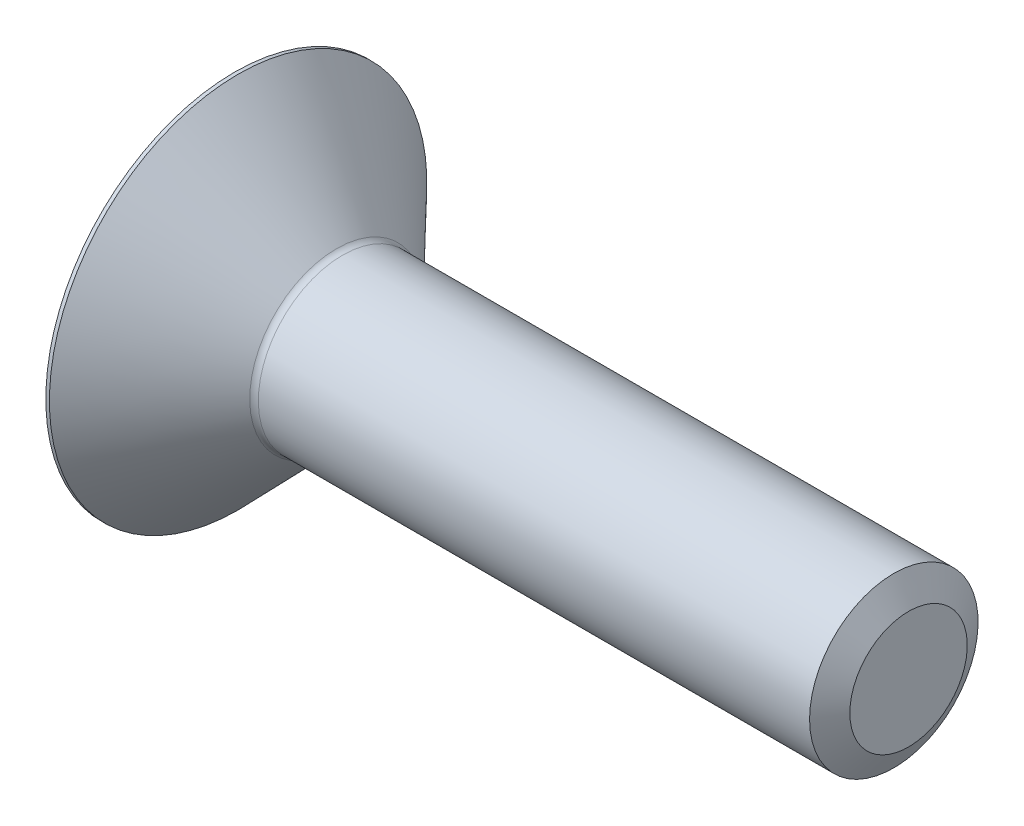
ISO-10303-21;
HEADER;
FILE_DESCRIPTION(('STEP AP214'),'2;1');
FILE_NAME('part.step','',(''),(''),'','','');
FILE_SCHEMA(('AUTOMOTIVE_DESIGN { 1 0 10303 214 1 1 1 1 }'));
ENDSEC;
DATA;
#1=APPLICATION_CONTEXT('core data for automotive mechanical design processes');
#2=APPLICATION_PROTOCOL_DEFINITION('international standard','automotive_design',2000,#1);
#3=PRODUCT_CONTEXT('',#1,'mechanical');
#4=PRODUCT('Part','Part','',(#3));
#5=PRODUCT_RELATED_PRODUCT_CATEGORY('part','',(#4));
#6=PRODUCT_DEFINITION_FORMATION('','',#4);
#7=PRODUCT_DEFINITION_CONTEXT('part definition',#1,'design');
#8=PRODUCT_DEFINITION('design','',#6,#7);
#9=PRODUCT_DEFINITION_SHAPE('','',#8);
#10=(LENGTH_UNIT() NAMED_UNIT(*) SI_UNIT(.MILLI.,.METRE.));
#11=(NAMED_UNIT(*) PLANE_ANGLE_UNIT() SI_UNIT($,.RADIAN.));
#12=(NAMED_UNIT(*) SI_UNIT($,.STERADIAN.) SOLID_ANGLE_UNIT());
#13=UNCERTAINTY_MEASURE_WITH_UNIT(LENGTH_MEASURE(1.E-05),#10,'distance_accuracy_value','');
#14=(GEOMETRIC_REPRESENTATION_CONTEXT(3) GLOBAL_UNCERTAINTY_ASSIGNED_CONTEXT((#13)) GLOBAL_UNIT_ASSIGNED_CONTEXT((#10,
#11,#12)) REPRESENTATION_CONTEXT('',''));
#15=CARTESIAN_POINT('',(0.,0.,0.));
#16=DIRECTION('',(0.,0.,1.));
#17=DIRECTION('',(1.,0.,0.));
#18=AXIS2_PLACEMENT_3D('',#15,#16,#17);
#19=CARTESIAN_POINT('',(0.,0.,0.));
#20=DIRECTION('',(1.,0.,0.));
#21=DIRECTION('',(0.,1.,0.));
#22=AXIS2_PLACEMENT_3D('',#19,#20,#21);
#23=CYLINDRICAL_SURFACE('',#22,2.);
#24=CARTESIAN_POINT('',(-13.4351050367581,0.,0.));
#25=DIRECTION('',(1.,0.,0.));
#26=DIRECTION('',(0.,1.,0.));
#27=AXIS2_PLACEMENT_3D('',#24,#25,#26);
#28=CIRCLE('',#27,2.);
#29=CARTESIAN_POINT('',(-13.4351050367581,2.,0.));
#30=VERTEX_POINT('',#29);
#31=EDGE_CURVE('E125',#30,#30,#28,.T.);
#32=ORIENTED_EDGE('',*,*,#31,.T.);
#33=EDGE_LOOP('',(#32));
#34=FACE_BOUND('',#33,.T.);
#35=CARTESIAN_POINT('',(-0.349999999999999,0.,0.));
#36=DIRECTION('',(-1.,0.,0.));
#37=DIRECTION('',(0.,0.,1.));
#38=AXIS2_PLACEMENT_3D('',#35,#36,#37);
#39=CIRCLE('',#38,2.);
#40=CARTESIAN_POINT('',(-0.349999999999999,0.,2.));
#41=VERTEX_POINT('',#40);
#42=EDGE_CURVE('E312',#41,#41,#39,.T.);
#43=ORIENTED_EDGE('',*,*,#42,.T.);
#44=EDGE_LOOP('',(#43));
#45=FACE_BOUND('',#44,.T.);
#46=ADVANCED_FACE('F38',(#34,#45),#23,.T.);
#47=CARTESIAN_POINT('',(-16.,4.48,0.));
#48=DIRECTION('',(-1.,0.,0.));
#49=DIRECTION('',(0.,-1.,0.));
#50=AXIS2_PLACEMENT_3D('',#47,#48,#49);
#51=PLANE('',#50);
#52=CARTESIAN_POINT('',(-16.,0.,0.));
#53=DIRECTION('',(1.,0.,0.));
#54=DIRECTION('',(0.,1.,0.));
#55=AXIS2_PLACEMENT_3D('',#52,#53,#54);
#56=CIRCLE('',#55,4.48);
#57=CARTESIAN_POINT('',(-16.,4.48,0.));
#58=VERTEX_POINT('',#57);
#59=EDGE_CURVE('E214',#58,#58,#56,.T.);
#60=ORIENTED_EDGE('',*,*,#59,.F.);
#61=EDGE_LOOP('',(#60));
#62=FACE_BOUND('',#61,.T.);
#63=CARTESIAN_POINT('',(-16.,0.,0.));
#64=DIRECTION('',(-1.,0.,0.));
#65=DIRECTION('',(0.,-1.,0.));
#66=AXIS2_PLACEMENT_3D('',#63,#64,#65);
#67=CIRCLE('',#66,1.44337567297406);
#68=CARTESIAN_POINT('',(-16.,-0.72168783648704,1.24999999999999));
#69=VERTEX_POINT('',#68);
#70=CARTESIAN_POINT('',(-16.,-1.44337567297406,0.));
#71=VERTEX_POINT('',#70);
#72=EDGE_CURVE('E42',#69,#71,#67,.F.);
#73=ORIENTED_EDGE('',*,*,#72,.T.);
#74=CARTESIAN_POINT('',(-16.,-0.72168783648704,-1.24999999999999));
#75=VERTEX_POINT('',#74);
#76=EDGE_CURVE('E11',#71,#75,#67,.F.);
#77=ORIENTED_EDGE('',*,*,#76,.T.);
#78=CARTESIAN_POINT('',(-16.,0.72168783648703,-1.25));
#79=VERTEX_POINT('',#78);
#80=EDGE_CURVE('E47',#75,#79,#67,.F.);
#81=ORIENTED_EDGE('',*,*,#80,.T.);
#82=CARTESIAN_POINT('',(-16.,1.44337567297406,0.));
#83=VERTEX_POINT('',#82);
#84=EDGE_CURVE('E112',#79,#83,#67,.F.);
#85=ORIENTED_EDGE('',*,*,#84,.T.);
#86=CARTESIAN_POINT('',(-16.,0.,0.));
#87=DIRECTION('',(-1.,0.,0.));
#88=DIRECTION('',(0.,0.,1.));
#89=AXIS2_PLACEMENT_3D('',#86,#87,#88);
#90=CIRCLE('',#89,1.44337567297406);
#91=CARTESIAN_POINT('',(-16.,0.721687836487035,1.25));
#92=VERTEX_POINT('',#91);
#93=EDGE_CURVE('E97',#92,#83,#90,.T.);
#94=ORIENTED_EDGE('',*,*,#93,.F.);
#95=EDGE_CURVE('E106',#92,#69,#67,.F.);
#96=ORIENTED_EDGE('',*,*,#95,.T.);
#97=EDGE_LOOP('',(#73,#77,#81,#85,#94,#96));
#98=FACE_BOUND('',#97,.T.);
#99=ADVANCED_FACE('F113',(#62,#98),#51,.T.);
#100=CARTESIAN_POINT('',(0.,0.,0.));
#101=DIRECTION('',(1.,0.,0.));
#102=DIRECTION('',(0.,1.,0.));
#103=AXIS2_PLACEMENT_3D('',#100,#101,#102);
#104=CYLINDRICAL_SURFACE('',#103,4.48);
#105=ORIENTED_EDGE('',*,*,#59,.T.);
#106=EDGE_LOOP('',(#105));
#107=FACE_BOUND('',#106,.T.);
#108=CARTESIAN_POINT('',(-15.9149081615215,0.,0.));
#109=DIRECTION('',(1.,0.,0.));
#110=DIRECTION('',(0.,1.,0.));
#111=AXIS2_PLACEMENT_3D('',#108,#109,#110);
#112=CIRCLE('',#111,4.48);
#113=CARTESIAN_POINT('',(-15.9149081615215,4.48,0.));
#114=VERTEX_POINT('',#113);
#115=EDGE_CURVE('E216',#114,#114,#112,.T.);
#116=ORIENTED_EDGE('',*,*,#115,.F.);
#117=EDGE_LOOP('',(#116));
#118=FACE_BOUND('',#117,.T.);
#119=ADVANCED_FACE('F204',(#107,#118),#104,.T.);
#120=CARTESIAN_POINT('',(-13.5789729968258,0.,0.));
#121=DIRECTION('',(-1.,0.,0.));
#122=DIRECTION('',(0.,-1.,0.));
#123=AXIS2_PLACEMENT_3D('',#120,#121,#122);
#124=CONICAL_SURFACE('',#123,2.0610683259082,0.802851455917393);
#125=ORIENTED_EDGE('',*,*,#115,.T.);
#126=EDGE_LOOP('',(#125));
#127=FACE_BOUND('',#126,.T.);
#128=CARTESIAN_POINT('',(-13.5789729968258,0.,0.));
#129=DIRECTION('',(1.,0.,0.));
#130=DIRECTION('',(0.,1.,0.));
#131=AXIS2_PLACEMENT_3D('',#128,#129,#130);
#132=CIRCLE('',#131,2.0610683259082);
#133=CARTESIAN_POINT('',(-13.5789729968258,2.0610683259082,0.));
#134=VERTEX_POINT('',#133);
#135=EDGE_CURVE('E220',#134,#134,#132,.T.);
#136=ORIENTED_EDGE('',*,*,#135,.F.);
#137=EDGE_LOOP('',(#136));
#138=FACE_BOUND('',#137,.T.);
#139=ADVANCED_FACE('F200',(#127,#138),#124,.T.);
#140=CARTESIAN_POINT('',(-13.4351050367581,0.,0.));
#141=DIRECTION('',(1.,0.,0.));
#142=DIRECTION('',(0.,1.,0.));
#143=AXIS2_PLACEMENT_3D('',#140,#141,#142);
#144=TOROIDAL_SURFACE('',#143,2.2,0.200000000000001);
#145=ORIENTED_EDGE('',*,*,#135,.T.);
#146=EDGE_LOOP('',(#145));
#147=FACE_BOUND('',#146,.T.);
#148=ORIENTED_EDGE('',*,*,#31,.F.);
#149=EDGE_LOOP('',(#148));
#150=FACE_BOUND('',#149,.T.);
#151=ADVANCED_FACE('F196',(#147,#150),#144,.F.);
#152=CARTESIAN_POINT('',(-15.593,0.,0.));
#153=DIRECTION('',(-1.,0.,0.));
#154=DIRECTION('',(0.,0.,1.));
#155=AXIS2_PLACEMENT_3D('',#152,#153,#154);
#156=CONICAL_SURFACE('',#155,0.,1.29595448752628);
#157=CARTESIAN_POINT('',(-16.0000325639069,-0.721572366433197,1.2502));
#158=CARTESIAN_POINT('',(-15.991576864719,-0.751541131585369,1.19829257611634));
#159=CARTESIAN_POINT('',(-15.9838983725877,-0.781569978777702,1.1462810870865));
#160=CARTESIAN_POINT('',(-15.9704054515754,-0.841745134078228,1.04205466075264));
#161=CARTESIAN_POINT('',(-15.964591866691,-0.871891489137524,0.989839642126926));
#162=CARTESIAN_POINT('',(-15.9551735985119,-0.932099362057424,0.885556547214008));
#163=CARTESIAN_POINT('',(-15.9515564854096,-0.962160380653127,0.833489335678977));
#164=CARTESIAN_POINT('',(-15.9467061131036,-1.02232485811963,0.729281403896156));
#165=CARTESIAN_POINT('',(-15.9454723393403,-1.05242830642509,0.677140701948078));
#166=CARTESIAN_POINT('',(-15.9454723393403,-1.11263520303601,0.572859298051922));
#167=CARTESIAN_POINT('',(-15.9467061131036,-1.14273865134147,0.520718596103843));
#168=CARTESIAN_POINT('',(-15.9515564854096,-1.20290312880797,0.416510664321023));
#169=CARTESIAN_POINT('',(-15.9551735985119,-1.23296414740368,0.364443452785991));
#170=CARTESIAN_POINT('',(-15.964591866691,-1.29317202032358,0.260160357873074));
#171=CARTESIAN_POINT('',(-15.9704054515754,-1.32331837538287,0.207945339247364));
#172=CARTESIAN_POINT('',(-15.9838983725877,-1.3834935306834,0.103718912913505));
#173=CARTESIAN_POINT('',(-15.991576864719,-1.41352237787573,0.0517074238836614));
#174=CARTESIAN_POINT('',(-16.0000325639069,-1.4434911430279,-0.000199999999999701));
#175=B_SPLINE_CURVE_WITH_KNOTS('',3,(#157,#158,#159,#160,#161,#162,#163,#164,#165,#166,#167,
#168,#169,#170,#171,#172,#173,#174),.UNSPECIFIED.,.F.,.F.,(4,2,2,2,2,2,2,2,4),(0.,
0.18160374958483,0.36328957156208,0.543937414070992,0.72454625060746,0.905155087143927,
1.08580292965284,1.26748875163009,1.44909250121492),.UNSPECIFIED.);
#176=EDGE_CURVE('E131',#69,#71,#175,.T.);
#177=ORIENTED_EDGE('',*,*,#176,.T.);
#178=ORIENTED_EDGE('',*,*,#72,.F.);
#179=EDGE_LOOP('',(#177,#178));
#180=FACE_BOUND('',#179,.T.);
#181=ADVANCED_FACE('F199',(#180),#156,.F.);
#182=CARTESIAN_POINT('',(-16.230054854727,-1.88192774876372,1.25));
#183=CARTESIAN_POINT('',(-16.2168061816408,-1.8255137400607,1.25));
#184=CARTESIAN_POINT('',(-16.2037258112081,-1.76906017891574,1.25));
#185=CARTESIAN_POINT('',(-16.1779869751788,-1.65605409957583,1.25));
#186=CARTESIAN_POINT('',(-16.1653285307257,-1.59950157657073,1.25));
#187=CARTESIAN_POINT('',(-16.1280879422272,-1.42954612490577,1.25));
#188=CARTESIAN_POINT('',(-16.1042709227473,-1.31597293305458,1.25));
#189=CARTESIAN_POINT('',(-16.0599692539508,-1.08931538105831,1.25));
#190=CARTESIAN_POINT('',(-16.0394543826368,-0.976237048644354,1.25));
#191=CARTESIAN_POINT('',(-16.0031083621366,-0.749332532153091,1.25));
#192=CARTESIAN_POINT('',(-15.9872761488083,-0.635506524005941,1.25));
#193=CARTESIAN_POINT('',(-15.9623551261036,-0.405617067524412,1.25));
#194=CARTESIAN_POINT('',(-15.9533532269162,-0.289543448802649,1.25));
#195=CARTESIAN_POINT('',(-15.9465899221525,-0.115205222838837,1.25));
#196=CARTESIAN_POINT('',(-15.9454583626773,-0.0570644643245798,1.25));
#197=CARTESIAN_POINT('',(-15.9454865772141,0.0592166170352015,1.25));
#198=CARTESIAN_POINT('',(-15.9466463560642,0.117356939879547,1.25));
#199=CARTESIAN_POINT('',(-15.9535104843876,0.292169226773828,1.25));
#200=CARTESIAN_POINT('',(-15.9626193191916,0.408714396179601,1.25));
#201=CARTESIAN_POINT('',(-15.987953181016,0.64106205157089,1.25));
#202=CARTESIAN_POINT('',(-16.0041839479739,0.756863861904299,1.25));
#203=CARTESIAN_POINT('',(-16.0420513932587,0.991534965339215,1.25));
#204=CARTESIAN_POINT('',(-16.063850897622,1.11037712244683,1.25));
#205=CARTESIAN_POINT('',(-16.1107131319875,1.34742332227276,1.25));
#206=CARTESIAN_POINT('',(-16.1357764440616,1.46562724724241,1.25));
#207=CARTESIAN_POINT('',(-16.1880082919745,1.70160185265613,1.25));
#208=CARTESIAN_POINT('',(-16.2151774684754,1.81937238974697,1.25));
#209=CARTESIAN_POINT('',(-16.2709069397528,2.05458449010658,1.25));
#210=CARTESIAN_POINT('',(-16.2994672676032,2.17202604548372,1.25));
#211=CARTESIAN_POINT('',(-16.3571404984079,2.40505512634129,1.25));
#212=CARTESIAN_POINT('',(-16.3862403573857,2.52064589314675,1.25));
#213=CARTESIAN_POINT('',(-16.4451006119577,2.7516618269686,1.25));
#214=CARTESIAN_POINT('',(-16.4748610242592,2.86708698971762,1.25));
#215=CARTESIAN_POINT('',(-16.534817355156,3.09763737586545,1.25));
#216=CARTESIAN_POINT('',(-16.5650125463553,3.21276278881204,1.25));
#217=CARTESIAN_POINT('',(-16.6257689948511,3.44291215791421,1.25));
#218=CARTESIAN_POINT('',(-16.656330237577,3.55793611791373,1.25));
#219=CARTESIAN_POINT('',(-16.687019012393,3.67292565898518,1.25));
#220=B_SPLINE_CURVE_WITH_KNOTS('',3,(#182,#183,#184,#185,#186,#187,#188,#189,#190,#191,#192,
#193,#194,#195,#196,#197,#198,#199,#200,#201,#202,#203,#204,#205,#206,#207,#208,#209,#210,#211,
#212,#213,#214,#215,#216,#217,#218,#219),.UNSPECIFIED.,.F.,.F.,(4,2,2,2,2,2,2,2,2,2,2,2,2,2,2,2,
2,2,4),(0.,0.173845962501761,0.347700623700958,0.695803457931749,1.04051283645618,
1.38514381887278,1.73408963262349,1.90850297063879,2.08291667692807,2.43329501130733,
2.78395625407464,3.14636001893445,3.50882850410612,3.87140769831936,4.2339955168655,
4.59158519290897,4.94918392371833,5.30624137064038,5.66328465178794),.UNSPECIFIED.);
#221=EDGE_CURVE('E102',#92,#69,#220,.F.);
#222=ORIENTED_EDGE('',*,*,#221,.T.);
#223=ORIENTED_EDGE('',*,*,#95,.F.);
#224=EDGE_LOOP('',(#222,#223));
#225=FACE_BOUND('',#224,.T.);
#226=ADVANCED_FACE('F107',(#225),#156,.F.);
#227=CARTESIAN_POINT('',(-16.0000325639069,1.4434911430279,-0.000200000000000113));
#228=CARTESIAN_POINT('',(-15.991576864719,1.41352237787573,0.0517074238836605));
#229=CARTESIAN_POINT('',(-15.9838983725877,1.3834935306834,0.103718912913504));
#230=CARTESIAN_POINT('',(-15.9704054515754,1.32331837538287,0.207945339247363));
#231=CARTESIAN_POINT('',(-15.964591866691,1.29317202032357,0.260160357873074));
#232=CARTESIAN_POINT('',(-15.9551735985119,1.23296414740367,0.364443452785991));
#233=CARTESIAN_POINT('',(-15.9515564854096,1.20290312880797,0.416510664321023));
#234=CARTESIAN_POINT('',(-15.9467061131036,1.14273865134146,0.520718596103843));
#235=CARTESIAN_POINT('',(-15.9454723393403,1.11263520303601,0.572859298051922));
#236=CARTESIAN_POINT('',(-15.9454723393403,1.05242830642509,0.677140701948078));
#237=CARTESIAN_POINT('',(-15.9467061131036,1.02232485811963,0.729281403896156));
#238=CARTESIAN_POINT('',(-15.9515564854096,0.962160380653123,0.833489335678976));
#239=CARTESIAN_POINT('',(-15.9551735985119,0.932099362057419,0.885556547214008));
#240=CARTESIAN_POINT('',(-15.964591866691,0.871891489137519,0.989839642126926));
#241=CARTESIAN_POINT('',(-15.9704054515754,0.841745134078223,1.04205466075264));
#242=CARTESIAN_POINT('',(-15.9838983725877,0.781569978777697,1.1462810870865));
#243=CARTESIAN_POINT('',(-15.991576864719,0.751541131585364,1.19829257611634));
#244=CARTESIAN_POINT('',(-16.0000325639069,0.721572366433193,1.2502));
#245=B_SPLINE_CURVE_WITH_KNOTS('',3,(#227,#228,#229,#230,#231,#232,#233,#234,#235,#236,#237,
#238,#239,#240,#241,#242,#243,#244),.UNSPECIFIED.,.F.,.F.,(4,2,2,2,2,2,2,2,4),(0.,
0.18160374958483,0.36328957156208,0.543937414070993,0.72454625060746,0.905155087143927,
1.08580292965284,1.26748875163009,1.44909250121492),.UNSPECIFIED.);
#246=EDGE_CURVE('E93',#83,#92,#245,.T.);
#247=ORIENTED_EDGE('',*,*,#246,.T.);
#248=ORIENTED_EDGE('',*,*,#93,.T.);
#249=EDGE_LOOP('',(#247,#248));
#250=FACE_BOUND('',#249,.T.);
#251=ADVANCED_FACE('F95',(#250),#156,.F.);
#252=CARTESIAN_POINT('',(-16.0000325639069,0.721572366433192,-1.2502));
#253=CARTESIAN_POINT('',(-15.991576864719,0.751541131585364,-1.19829257611634));
#254=CARTESIAN_POINT('',(-15.9838983725877,0.781569978777697,-1.1462810870865));
#255=CARTESIAN_POINT('',(-15.9704054515754,0.841745134078223,-1.04205466075264));
#256=CARTESIAN_POINT('',(-15.964591866691,0.871891489137519,-0.989839642126926));
#257=CARTESIAN_POINT('',(-15.9551735985119,0.932099362057419,-0.885556547214009));
#258=CARTESIAN_POINT('',(-15.9515564854096,0.962160380653123,-0.833489335678977));
#259=CARTESIAN_POINT('',(-15.9467061131036,1.02232485811963,-0.729281403896157));
#260=CARTESIAN_POINT('',(-15.9454723393403,1.05242830642509,-0.677140701948078));
#261=CARTESIAN_POINT('',(-15.9454723393403,1.11263520303601,-0.572859298051922));
#262=CARTESIAN_POINT('',(-15.9467061131036,1.14273865134146,-0.520718596103844));
#263=CARTESIAN_POINT('',(-15.9515564854096,1.20290312880797,-0.416510664321023));
#264=CARTESIAN_POINT('',(-15.9551735985119,1.23296414740367,-0.364443452785991));
#265=CARTESIAN_POINT('',(-15.964591866691,1.29317202032357,-0.260160357873074));
#266=CARTESIAN_POINT('',(-15.9704054515754,1.32331837538287,-0.207945339247364));
#267=CARTESIAN_POINT('',(-15.9838983725877,1.3834935306834,-0.103718912913505));
#268=CARTESIAN_POINT('',(-15.991576864719,1.41352237787573,-0.0517074238836612));
#269=CARTESIAN_POINT('',(-16.0000325639069,1.4434911430279,0.000199999999999882));
#270=B_SPLINE_CURVE_WITH_KNOTS('',3,(#252,#253,#254,#255,#256,#257,#258,#259,#260,#261,#262,
#263,#264,#265,#266,#267,#268,#269),.UNSPECIFIED.,.F.,.F.,(4,2,2,2,2,2,2,2,4),(0.,
0.18160374958483,0.36328957156208,0.543937414070993,0.72454625060746,0.905155087143928,
1.08580292965284,1.26748875163009,1.44909250121492),.UNSPECIFIED.);
#271=EDGE_CURVE('E115',#79,#83,#270,.T.);
#272=ORIENTED_EDGE('',*,*,#271,.T.);
#273=ORIENTED_EDGE('',*,*,#84,.F.);
#274=EDGE_LOOP('',(#272,#273));
#275=FACE_BOUND('',#274,.T.);
#276=ADVANCED_FACE('F295',(#275),#156,.F.);
#277=CARTESIAN_POINT('',(-16.230054854727,-1.88192774876372,-1.25));
#278=CARTESIAN_POINT('',(-16.2168061816408,-1.8255137400607,-1.25));
#279=CARTESIAN_POINT('',(-16.2037258112081,-1.76906017891574,-1.25));
#280=CARTESIAN_POINT('',(-16.1779869751788,-1.65605409957583,-1.25));
#281=CARTESIAN_POINT('',(-16.1653285307257,-1.59950157657073,-1.25));
#282=CARTESIAN_POINT('',(-16.1280879422272,-1.42954612490577,-1.25));
#283=CARTESIAN_POINT('',(-16.1042709227473,-1.31597293305458,-1.25));
#284=CARTESIAN_POINT('',(-16.0599692539508,-1.08931538105831,-1.25));
#285=CARTESIAN_POINT('',(-16.0394543826368,-0.976237048644354,-1.25));
#286=CARTESIAN_POINT('',(-16.0031083621366,-0.74933253215309,-1.25));
#287=CARTESIAN_POINT('',(-15.9872761488083,-0.635506524005941,-1.25));
#288=CARTESIAN_POINT('',(-15.9623551261036,-0.405617067524411,-1.25));
#289=CARTESIAN_POINT('',(-15.9533532269162,-0.289543448802648,-1.25));
#290=CARTESIAN_POINT('',(-15.9465899221525,-0.115205222838836,-1.25));
#291=CARTESIAN_POINT('',(-15.9454583626773,-0.0570644643245787,-1.25));
#292=CARTESIAN_POINT('',(-15.9454865772141,0.0592166170352027,-1.25));
#293=CARTESIAN_POINT('',(-15.9466463560642,0.117356939879548,-1.25));
#294=CARTESIAN_POINT('',(-15.9535104843876,0.292169226773829,-1.25));
#295=CARTESIAN_POINT('',(-15.9626193191916,0.408714396179602,-1.25));
#296=CARTESIAN_POINT('',(-15.987953181016,0.641062051570891,-1.25));
#297=CARTESIAN_POINT('',(-16.0041839479739,0.7568638619043,-1.25));
#298=CARTESIAN_POINT('',(-16.0420513932587,0.991534965339216,-1.25));
#299=CARTESIAN_POINT('',(-16.063850897622,1.11037712244683,-1.25));
#300=CARTESIAN_POINT('',(-16.1107131319875,1.34742332227276,-1.25));
#301=CARTESIAN_POINT('',(-16.1357764440616,1.46562724724241,-1.25));
#302=CARTESIAN_POINT('',(-16.1880082919745,1.70160185265613,-1.25));
#303=CARTESIAN_POINT('',(-16.2151774684754,1.81937238974697,-1.25));
#304=CARTESIAN_POINT('',(-16.2709069397528,2.05458449010658,-1.25));
#305=CARTESIAN_POINT('',(-16.2994672676032,2.17202604548372,-1.25));
#306=CARTESIAN_POINT('',(-16.3571404984079,2.40505512634129,-1.25));
#307=CARTESIAN_POINT('',(-16.3862403573857,2.52064589314675,-1.25));
#308=CARTESIAN_POINT('',(-16.4451006119577,2.7516618269686,-1.25));
#309=CARTESIAN_POINT('',(-16.4748610242592,2.86708698971762,-1.25));
#310=CARTESIAN_POINT('',(-16.534817355156,3.09763737586545,-1.25));
#311=CARTESIAN_POINT('',(-16.5650125463553,3.21276278881204,-1.25));
#312=CARTESIAN_POINT('',(-16.6257689948511,3.44291215791421,-1.25));
#313=CARTESIAN_POINT('',(-16.656330237577,3.55793611791373,-1.25));
#314=CARTESIAN_POINT('',(-16.687019012393,3.67292565898518,-1.25));
#315=B_SPLINE_CURVE_WITH_KNOTS('',3,(#277,#278,#279,#280,#281,#282,#283,#284,#285,#286,#287,
#288,#289,#290,#291,#292,#293,#294,#295,#296,#297,#298,#299,#300,#301,#302,#303,#304,#305,#306,
#307,#308,#309,#310,#311,#312,#313,#314),.UNSPECIFIED.,.F.,.F.,(4,2,2,2,2,2,2,2,2,2,2,2,2,2,2,2,
2,2,4),(0.,0.17384596250176,0.347700623700958,0.695803457931749,1.04051283645618,
1.38514381887278,1.73408963262349,1.90850297063879,2.08291667692807,2.43329501130733,
2.78395625407464,3.14636001893446,3.50882850410612,3.87140769831936,4.2339955168655,
4.59158519290896,4.94918392371833,5.30624137064038,5.66328465178794),.UNSPECIFIED.);
#316=EDGE_CURVE('E250',#75,#79,#315,.T.);
#317=ORIENTED_EDGE('',*,*,#316,.T.);
#318=ORIENTED_EDGE('',*,*,#80,.F.);
#319=EDGE_LOOP('',(#317,#318));
#320=FACE_BOUND('',#319,.T.);
#321=ADVANCED_FACE('F282',(#320),#156,.F.);
#322=CARTESIAN_POINT('',(-16.0000325639069,-1.4434911430279,0.000199999999999665));
#323=CARTESIAN_POINT('',(-15.991576864719,-1.41352237787573,-0.0517074238836611));
#324=CARTESIAN_POINT('',(-15.9838983725877,-1.3834935306834,-0.103718912913504));
#325=CARTESIAN_POINT('',(-15.9704054515754,-1.32331837538287,-0.207945339247363));
#326=CARTESIAN_POINT('',(-15.964591866691,-1.29317202032358,-0.260160357873074));
#327=CARTESIAN_POINT('',(-15.9551735985119,-1.23296414740368,-0.364443452785991));
#328=CARTESIAN_POINT('',(-15.9515564854096,-1.20290312880797,-0.416510664321023));
#329=CARTESIAN_POINT('',(-15.9467061131036,-1.14273865134147,-0.520718596103844));
#330=CARTESIAN_POINT('',(-15.9454723393403,-1.11263520303601,-0.572859298051922));
#331=CARTESIAN_POINT('',(-15.9454723393403,-1.05242830642509,-0.677140701948078));
#332=CARTESIAN_POINT('',(-15.9467061131036,-1.02232485811963,-0.729281403896157));
#333=CARTESIAN_POINT('',(-15.9515564854096,-0.962160380653126,-0.833489335678977));
#334=CARTESIAN_POINT('',(-15.9551735985119,-0.932099362057423,-0.885556547214009));
#335=CARTESIAN_POINT('',(-15.964591866691,-0.871891489137523,-0.989839642126926));
#336=CARTESIAN_POINT('',(-15.9704054515754,-0.841745134078227,-1.04205466075264));
#337=CARTESIAN_POINT('',(-15.9838983725877,-0.781569978777701,-1.1462810870865));
#338=CARTESIAN_POINT('',(-15.991576864719,-0.751541131585368,-1.19829257611634));
#339=CARTESIAN_POINT('',(-16.0000325639069,-0.721572366433196,-1.2502));
#340=B_SPLINE_CURVE_WITH_KNOTS('',3,(#322,#323,#324,#325,#326,#327,#328,#329,#330,#331,#332,
#333,#334,#335,#336,#337,#338,#339),.UNSPECIFIED.,.F.,.F.,(4,2,2,2,2,2,2,2,4),(0.,
0.18160374958483,0.363289571562081,0.543937414070993,0.72454625060746,0.905155087143928,
1.08580292965284,1.26748875163009,1.44909250121492),.UNSPECIFIED.);
#341=EDGE_CURVE('E133',#71,#75,#340,.T.);
#342=ORIENTED_EDGE('',*,*,#341,.T.);
#343=ORIENTED_EDGE('',*,*,#76,.F.);
#344=EDGE_LOOP('',(#342,#343));
#345=FACE_BOUND('',#344,.T.);
#346=ADVANCED_FACE('F285',(#345),#156,.F.);
#347=CARTESIAN_POINT('',(-14.5,0.,0.));
#348=DIRECTION('',(-1.,0.,0.));
#349=DIRECTION('',(0.,0.,1.));
#350=AXIS2_PLACEMENT_3D('',#347,#348,#349);
#351=CONICAL_SURFACE('',#350,1.44337567297406,1.0471975511966);
#352=CARTESIAN_POINT('',(-13.6666666666667,0.,0.));
#353=VERTEX_POINT('',#352);
#354=VERTEX_LOOP('',#353);
#355=FACE_BOUND('',#354,.T.);
#356=CARTESIAN_POINT('',(-14.9647941109243,-1.86893140179217,1.25));
#357=CARTESIAN_POINT('',(-14.9388968384665,-1.81495202267025,1.25));
#358=CARTESIAN_POINT('',(-14.9132686219312,-1.76084125344196,1.25));
#359=CARTESIAN_POINT('',(-14.8627027606134,-1.65228662652066,1.25));
#360=CARTESIAN_POINT('',(-14.8377652401103,-1.59784271100767,1.25));
#361=CARTESIAN_POINT('',(-14.7885939163498,-1.48823931692675,1.25));
#362=CARTESIAN_POINT('',(-14.7643652994868,-1.43307750108907,1.25));
#363=CARTESIAN_POINT('',(-14.7169950705039,-1.3222918844362,1.25));
#364=CARTESIAN_POINT('',(-14.6938534018645,-1.26666810781962,1.25));
#365=CARTESIAN_POINT('',(-14.6483546130678,-1.15340083047608,1.25));
#366=CARTESIAN_POINT('',(-14.6260338154653,-1.09574254265115,1.25));
#367=CARTESIAN_POINT('',(-14.583255476912,-0.979741082890173,1.25));
#368=CARTESIAN_POINT('',(-14.5627981694397,-0.921397826164637,1.25));
#369=CARTESIAN_POINT('',(-14.5050842376762,-0.745435524772239,1.25));
#370=CARTESIAN_POINT('',(-14.4713502149769,-0.626561938132859,1.25));
#371=CARTESIAN_POINT('',(-14.4322204068282,-0.445873083681238,1.25));
#372=CARTESIAN_POINT('',(-14.4210940606188,-0.385304700192767,1.25));
#373=CARTESIAN_POINT('',(-14.4034278522676,-0.26348659206503,1.25));
#374=CARTESIAN_POINT('',(-14.3968876801832,-0.202236913753246,1.25));
#375=CARTESIAN_POINT('',(-14.3889987810428,-0.0801324468775838,1.25));
#376=CARTESIAN_POINT('',(-14.3875887912582,-0.0192817197887155,1.25));
#377=CARTESIAN_POINT('',(-14.3899161878862,0.102319232701153,1.25));
#378=CARTESIAN_POINT('',(-14.393653893026,0.163069451645861,1.25));
#379=CARTESIAN_POINT('',(-14.4088980280361,0.312961598922925,1.25));
#380=CARTESIAN_POINT('',(-14.4232612484297,0.40181305562826,1.25));
#381=CARTESIAN_POINT('',(-14.4602998495149,0.577788146583197,1.25));
#382=CARTESIAN_POINT('',(-14.4829852483541,0.664909564430747,1.25));
#383=CARTESIAN_POINT('',(-14.5217374532821,0.795209224728789,1.25));
#384=CARTESIAN_POINT('',(-14.5356229448103,0.839061001813531,1.25));
#385=CARTESIAN_POINT('',(-14.5646784153621,0.926308087473951,1.25));
#386=CARTESIAN_POINT('',(-14.5798475927664,0.969703662172457,1.25));
#387=CARTESIAN_POINT('',(-14.6112501339966,1.05609633508793,1.25));
#388=CARTESIAN_POINT('',(-14.627483304423,1.09909350410933,1.25));
#389=CARTESIAN_POINT('',(-14.6608382439108,1.18474903910479,1.25));
#390=CARTESIAN_POINT('',(-14.6779601631043,1.22740734642399,1.25));
#391=CARTESIAN_POINT('',(-14.7227614292321,1.33629459550825,1.25));
#392=CARTESIAN_POINT('',(-14.7509693835735,1.40230581092028,1.25));
#393=CARTESIAN_POINT('',(-14.8087450811585,1.53373213594212,1.25));
#394=CARTESIAN_POINT('',(-14.8383129262699,1.59914720045374,1.25));
#395=CARTESIAN_POINT('',(-14.9285769200244,1.79469680395942,1.25));
#396=CARTESIAN_POINT('',(-14.9908242731852,1.92411390982368,1.25));
#397=CARTESIAN_POINT('',(-15.1179296229027,2.18184246876936,1.25));
#398=CARTESIAN_POINT('',(-15.182790734765,2.31015236703661,1.25));
#399=CARTESIAN_POINT('',(-15.3141807455314,2.56589305685455,1.25));
#400=CARTESIAN_POINT('',(-15.3807094324427,2.69332395754888,1.25));
#401=CARTESIAN_POINT('',(-15.5085820016458,2.93557826301821,1.25));
#402=CARTESIAN_POINT('',(-15.5698225704122,3.05045639113075,1.25));
#403=CARTESIAN_POINT('',(-15.6930014800409,3.27984311898855,1.25));
#404=CARTESIAN_POINT('',(-15.7549398467262,3.39435170485538,1.25));
#405=CARTESIAN_POINT('',(-15.8791811560561,3.62279327872168,1.25));
#406=CARTESIAN_POINT('',(-15.941482770676,3.73672698995313,1.25));
#407=CARTESIAN_POINT('',(-16.0664914919315,3.96436406629494,1.25));
#408=CARTESIAN_POINT('',(-16.1291985771761,4.07806744314787,1.25));
#409=CARTESIAN_POINT('',(-16.1920543493623,4.19168806612954,1.25));
#410=B_SPLINE_CURVE_WITH_KNOTS('',3,(#356,#357,#358,#359,#360,#361,#362,#363,#364,#365,#366,
#367,#368,#369,#370,#371,#372,#373,#374,#375,#376,#377,#378,#379,#380,#381,#382,#383,#384,#385,
#386,#387,#388,#389,#390,#391,#392,#393,#394,#395,#396,#397,#398,#399,#400,#401,#402,#403,#404,
#405,#406,#407,#408,#409),.UNSPECIFIED.,.F.,.F.,(4,2,2,2,2,2,2,2,2,2,2,2,2,2,2,2,2,2,2,2,2,2,2,
2,2,2,4),(0.,0.179612926712516,0.359257964580627,0.539992735616911,0.720718098311215,
0.906167781883879,1.09164066876279,1.4615401462125,1.64614554413147,1.83073846485713,
2.01311967401941,2.19551217609307,2.46497297688035,2.73475922178117,2.87273702323329,
3.01062928909397,3.14849655975686,3.28638719597089,3.50172172546908,3.7170724117864,
4.14784491349865,4.57914698286382,5.01039449766869,5.40093821140478,5.79149642546539,
6.18106124184771,6.57060567131893),.UNSPECIFIED.);
#411=CARTESIAN_POINT('',(-14.5,-0.721687836487035,1.25));
#412=VERTEX_POINT('',#411);
#413=CARTESIAN_POINT('',(-14.5,0.721687836487031,1.25));
#414=VERTEX_POINT('',#413);
#415=EDGE_CURVE('E165',#412,#414,#410,.T.);
#416=ORIENTED_EDGE('',*,*,#415,.T.);
#417=CARTESIAN_POINT('',(-14.500066674666,0.721572366433193,1.2502));
#418=CARTESIAN_POINT('',(-14.4817459147637,0.753288124996228,1.19526669476824));
#419=CARTESIAN_POINT('',(-14.4650833062006,0.785277649221701,1.13985921349976));
#420=CARTESIAN_POINT('',(-14.4359973039458,0.849810733708401,1.02808463239966));
#421=CARTESIAN_POINT('',(-14.4235842019761,0.88235544140118,0.97171554515829));
#422=CARTESIAN_POINT('',(-14.404259687636,0.947041487997315,0.859676025913016));
#423=CARTESIAN_POINT('',(-14.3972196894474,0.979172868975891,0.804022841540771));
#424=CARTESIAN_POINT('',(-14.3888124326306,1.04358696985655,0.692454346091609));
#425=CARTESIAN_POINT('',(-14.3874382152047,1.07586945532687,0.6365394410624));
#426=CARTESIAN_POINT('',(-14.3902833373679,1.13620103554812,0.532042078818275));
#427=CARTESIAN_POINT('',(-14.39380409882,1.16425912049992,0.483444050118685));
#428=CARTESIAN_POINT('',(-14.4049671126993,1.22019247526559,0.386564637826762));
#429=CARTESIAN_POINT('',(-14.4126131855727,1.24806755133607,0.338283589807837));
#430=CARTESIAN_POINT('',(-14.4317294547005,1.30411641158755,0.241204116145957));
#431=CARTESIAN_POINT('',(-14.4432807569797,1.3322830948538,0.192417989648101));
#432=CARTESIAN_POINT('',(-14.4694983146939,1.38819614400745,0.0955737477078981));
#433=CARTESIAN_POINT('',(-14.4841584021391,1.41594322730595,0.0475143896730358));
#434=CARTESIAN_POINT('',(-14.500066674666,1.4434911430279,-0.000199999999999986));
#435=B_SPLINE_CURVE_WITH_KNOTS('',3,(#417,#418,#419,#420,#421,#422,#423,#424,#425,#426,#427,
#428,#429,#430,#431,#432,#433,#434),.UNSPECIFIED.,.F.,.F.,(4,2,2,2,2,2,2,2,4),(0.,
0.198150821029559,0.396778196315221,0.5904886173544,0.783961049317181,0.952480056398646,
1.1211553973001,1.2935743034359,1.4656542697693),.UNSPECIFIED.);
#436=CARTESIAN_POINT('',(-14.5,1.44337567297406,0.));
#437=VERTEX_POINT('',#436);
#438=EDGE_CURVE('E122',#414,#437,#435,.T.);
#439=ORIENTED_EDGE('',*,*,#438,.T.);
#440=CARTESIAN_POINT('',(-14.500066674666,1.4434911430279,0.000199999999999734));
#441=CARTESIAN_POINT('',(-14.4817459147637,1.41177538446486,-0.0547333052317653));
#442=CARTESIAN_POINT('',(-14.4650833062006,1.37978586023939,-0.11014078650024));
#443=CARTESIAN_POINT('',(-14.4359973039458,1.31525277575269,-0.22191536760034));
#444=CARTESIAN_POINT('',(-14.4235842019761,1.28270806805991,-0.27828445484171));
#445=CARTESIAN_POINT('',(-14.404259687636,1.21802202146378,-0.390323974086984));
#446=CARTESIAN_POINT('',(-14.3972196894474,1.1858906404852,-0.445977158459229));
#447=CARTESIAN_POINT('',(-14.3888124326306,1.12147653960455,-0.557545653908391));
#448=CARTESIAN_POINT('',(-14.3874382152047,1.08919405413422,-0.613460558937599));
#449=CARTESIAN_POINT('',(-14.3902833373679,1.02886247391297,-0.717957921181724));
#450=CARTESIAN_POINT('',(-14.39380409882,1.00080438896118,-0.766555949881314));
#451=CARTESIAN_POINT('',(-14.4049671126993,0.944871034195502,-0.863435362173237));
#452=CARTESIAN_POINT('',(-14.4126131855727,0.916995958125019,-0.911716410192162));
#453=CARTESIAN_POINT('',(-14.4317294547005,0.860947097873545,-1.00879588385404));
#454=CARTESIAN_POINT('',(-14.4432807569797,0.832780414607289,-1.0575820103519));
#455=CARTESIAN_POINT('',(-14.4694983146939,0.776867365453647,-1.1544262522921));
#456=CARTESIAN_POINT('',(-14.4841584021391,0.749120282155139,-1.20248561032696));
#457=CARTESIAN_POINT('',(-14.500066674666,0.721572366433193,-1.2502));
#458=B_SPLINE_CURVE_WITH_KNOTS('',3,(#440,#441,#442,#443,#444,#445,#446,#447,#448,#449,#450,
#451,#452,#453,#454,#455,#456,#457),.UNSPECIFIED.,.F.,.F.,(4,2,2,2,2,2,2,2,4),(0.,
0.198150821029559,0.39677819631522,0.590488617354398,0.78396104931718,0.952480056398644,
1.1211553973001,1.2935743034359,1.4656542697693),.UNSPECIFIED.);
#459=CARTESIAN_POINT('',(-14.5,0.721687836487032,-1.25));
#460=VERTEX_POINT('',#459);
#461=EDGE_CURVE('E215',#437,#460,#458,.T.);
#462=ORIENTED_EDGE('',*,*,#461,.T.);
#463=CARTESIAN_POINT('',(-14.9647941109243,-1.86893140179217,-1.25));
#464=CARTESIAN_POINT('',(-14.9388968384665,-1.81495202267025,-1.25));
#465=CARTESIAN_POINT('',(-14.9132686219312,-1.76084125344196,-1.25));
#466=CARTESIAN_POINT('',(-14.8627027606134,-1.65228662652066,-1.25));
#467=CARTESIAN_POINT('',(-14.8377652401103,-1.59784271100767,-1.25));
#468=CARTESIAN_POINT('',(-14.7885939163498,-1.48823931692675,-1.25));
#469=CARTESIAN_POINT('',(-14.7643652994868,-1.43307750108907,-1.25));
#470=CARTESIAN_POINT('',(-14.7169950705039,-1.3222918844362,-1.25));
#471=CARTESIAN_POINT('',(-14.6938534018645,-1.26666810781962,-1.25));
#472=CARTESIAN_POINT('',(-14.6483546130678,-1.15340083047608,-1.25));
#473=CARTESIAN_POINT('',(-14.6260338154653,-1.09574254265115,-1.25));
#474=CARTESIAN_POINT('',(-14.583255476912,-0.979741082890172,-1.25));
#475=CARTESIAN_POINT('',(-14.5627981694397,-0.921397826164636,-1.25));
#476=CARTESIAN_POINT('',(-14.5050842376762,-0.745435524772239,-1.25));
#477=CARTESIAN_POINT('',(-14.4713502149769,-0.626561938132859,-1.25));
#478=CARTESIAN_POINT('',(-14.4322204068282,-0.445873083681238,-1.25));
#479=CARTESIAN_POINT('',(-14.4210940606188,-0.385304700192767,-1.25));
#480=CARTESIAN_POINT('',(-14.4034278522676,-0.263486592065029,-1.25));
#481=CARTESIAN_POINT('',(-14.3968876801832,-0.202236913753246,-1.25));
#482=CARTESIAN_POINT('',(-14.3889987810428,-0.0801324468775834,-1.25));
#483=CARTESIAN_POINT('',(-14.3875887912582,-0.019281719788715,-1.25));
#484=CARTESIAN_POINT('',(-14.3899161878862,0.102319232701154,-1.25));
#485=CARTESIAN_POINT('',(-14.393653893026,0.163069451645862,-1.25));
#486=CARTESIAN_POINT('',(-14.4088980280361,0.312961598922926,-1.25));
#487=CARTESIAN_POINT('',(-14.4232612484297,0.401813055628261,-1.25));
#488=CARTESIAN_POINT('',(-14.4602998495149,0.577788146583199,-1.25));
#489=CARTESIAN_POINT('',(-14.4829852483541,0.664909564430749,-1.25));
#490=CARTESIAN_POINT('',(-14.5217374532821,0.795209224728791,-1.25));
#491=CARTESIAN_POINT('',(-14.5356229448103,0.839061001813533,-1.25));
#492=CARTESIAN_POINT('',(-14.5646784153621,0.926308087473952,-1.25));
#493=CARTESIAN_POINT('',(-14.5798475927664,0.969703662172459,-1.25));
#494=CARTESIAN_POINT('',(-14.6112501339966,1.05609633508794,-1.25));
#495=CARTESIAN_POINT('',(-14.627483304423,1.09909350410933,-1.25));
#496=CARTESIAN_POINT('',(-14.6608382439108,1.18474903910479,-1.25));
#497=CARTESIAN_POINT('',(-14.6779601631043,1.22740734642399,-1.25));
#498=CARTESIAN_POINT('',(-14.7227614292321,1.33629459550825,-1.25));
#499=CARTESIAN_POINT('',(-14.7509693835735,1.40230581092028,-1.25));
#500=CARTESIAN_POINT('',(-14.8087450811585,1.53373213594212,-1.25));
#501=CARTESIAN_POINT('',(-14.8383129262699,1.59914720045374,-1.25));
#502=CARTESIAN_POINT('',(-14.9285769200244,1.79469680395942,-1.25));
#503=CARTESIAN_POINT('',(-14.9908242731852,1.92411390982368,-1.25));
#504=CARTESIAN_POINT('',(-15.1179296229027,2.18184246876936,-1.25));
#505=CARTESIAN_POINT('',(-15.182790734765,2.31015236703661,-1.25));
#506=CARTESIAN_POINT('',(-15.3141807455314,2.56589305685455,-1.25));
#507=CARTESIAN_POINT('',(-15.3807094324427,2.69332395754888,-1.25));
#508=CARTESIAN_POINT('',(-15.5085820016458,2.93557826301822,-1.25));
#509=CARTESIAN_POINT('',(-15.5698225704122,3.05045639113076,-1.25));
#510=CARTESIAN_POINT('',(-15.6930014800409,3.27984311898855,-1.25));
#511=CARTESIAN_POINT('',(-15.7549398467262,3.39435170485538,-1.25));
#512=CARTESIAN_POINT('',(-15.8791811560561,3.62279327872168,-1.25));
#513=CARTESIAN_POINT('',(-15.941482770676,3.73672698995313,-1.25));
#514=CARTESIAN_POINT('',(-16.0664914919315,3.96436406629495,-1.25));
#515=CARTESIAN_POINT('',(-16.1291985771761,4.07806744314788,-1.25));
#516=CARTESIAN_POINT('',(-16.1920543493623,4.19168806612954,-1.25));
#517=B_SPLINE_CURVE_WITH_KNOTS('',3,(#463,#464,#465,#466,#467,#468,#469,#470,#471,#472,#473,
#474,#475,#476,#477,#478,#479,#480,#481,#482,#483,#484,#485,#486,#487,#488,#489,#490,#491,#492,
#493,#494,#495,#496,#497,#498,#499,#500,#501,#502,#503,#504,#505,#506,#507,#508,#509,#510,#511,
#512,#513,#514,#515,#516),.UNSPECIFIED.,.F.,.F.,(4,2,2,2,2,2,2,2,2,2,2,2,2,2,2,2,2,2,2,2,2,2,2,
2,2,2,4),(0.,0.179612926712517,0.359257964580627,0.53999273561691,0.720718098311215,
0.906167781883879,1.09164066876279,1.4615401462125,1.64614554413147,1.83073846485713,
2.01311967401941,2.19551217609307,2.46497297688035,2.73475922178117,2.87273702323329,
3.01062928909397,3.14849655975686,3.28638719597089,3.50172172546908,3.7170724117864,
4.14784491349865,4.57914698286382,5.01039449766869,5.40093821140478,5.79149642546539,
6.18106124184771,6.57060567131893),.UNSPECIFIED.);
#518=CARTESIAN_POINT('',(-14.5,-0.721687836487034,-1.25));
#519=VERTEX_POINT('',#518);
#520=EDGE_CURVE('E101',#460,#519,#517,.F.);
#521=ORIENTED_EDGE('',*,*,#520,.T.);
#522=CARTESIAN_POINT('',(-14.500066674666,-0.721572366433196,-1.2502));
#523=CARTESIAN_POINT('',(-14.4817459147637,-0.753288124996232,-1.19526669476824));
#524=CARTESIAN_POINT('',(-14.4650833062006,-0.785277649221705,-1.13985921349976));
#525=CARTESIAN_POINT('',(-14.4359973039458,-0.849810733708405,-1.02808463239966));
#526=CARTESIAN_POINT('',(-14.4235842019761,-0.882355441401184,-0.97171554515829));
#527=CARTESIAN_POINT('',(-14.404259687636,-0.947041487997319,-0.859676025913015));
#528=CARTESIAN_POINT('',(-14.3972196894474,-0.979172868975895,-0.80402284154077));
#529=CARTESIAN_POINT('',(-14.3888124326306,-1.04358696985655,-0.692454346091609));
#530=CARTESIAN_POINT('',(-14.3874382152047,-1.07586945532688,-0.6365394410624));
#531=CARTESIAN_POINT('',(-14.3902833373679,-1.13620103554813,-0.532042078818275));
#532=CARTESIAN_POINT('',(-14.39380409882,-1.16425912049992,-0.483444050118685));
#533=CARTESIAN_POINT('',(-14.4049671126993,-1.2201924752656,-0.386564637826762));
#534=CARTESIAN_POINT('',(-14.4126131855727,-1.24806755133608,-0.338283589807837));
#535=CARTESIAN_POINT('',(-14.4317294547005,-1.30411641158755,-0.241204116145957));
#536=CARTESIAN_POINT('',(-14.4432807569797,-1.33228309485381,-0.1924179896481));
#537=CARTESIAN_POINT('',(-14.4694983146939,-1.38819614400745,-0.0955737477078977));
#538=CARTESIAN_POINT('',(-14.4841584021391,-1.41594322730596,-0.0475143896730356));
#539=CARTESIAN_POINT('',(-14.500066674666,-1.4434911430279,0.000199999999999961));
#540=B_SPLINE_CURVE_WITH_KNOTS('',3,(#522,#523,#524,#525,#526,#527,#528,#529,#530,#531,#532,
#533,#534,#535,#536,#537,#538,#539),.UNSPECIFIED.,.F.,.F.,(4,2,2,2,2,2,2,2,4),(0.,
0.198150821029559,0.396778196315221,0.5904886173544,0.783961049317181,0.952480056398646,
1.1211553973001,1.2935743034359,1.4656542697693),.UNSPECIFIED.);
#541=CARTESIAN_POINT('',(-14.5,-1.44337567297407,0.));
#542=VERTEX_POINT('',#541);
#543=EDGE_CURVE('E267',#519,#542,#540,.T.);
#544=ORIENTED_EDGE('',*,*,#543,.T.);
#545=CARTESIAN_POINT('',(-14.500066674666,-1.4434911430279,-0.000200000000000103));
#546=CARTESIAN_POINT('',(-14.4817459147637,-1.41177538446487,0.054733305231765));
#547=CARTESIAN_POINT('',(-14.4650833062006,-1.3797858602394,0.11014078650024));
#548=CARTESIAN_POINT('',(-14.4359973039458,-1.3152527757527,0.22191536760034));
#549=CARTESIAN_POINT('',(-14.4235842019761,-1.28270806805992,0.27828445484171));
#550=CARTESIAN_POINT('',(-14.404259687636,-1.21802202146378,0.390323974086985));
#551=CARTESIAN_POINT('',(-14.3972196894474,-1.18589064048521,0.44597715845923));
#552=CARTESIAN_POINT('',(-14.3888124326306,-1.12147653960455,0.557545653908392));
#553=CARTESIAN_POINT('',(-14.3874382152047,-1.08919405413422,0.613460558937601));
#554=CARTESIAN_POINT('',(-14.3902833373679,-1.02886247391297,0.717957921181726));
#555=CARTESIAN_POINT('',(-14.39380409882,-1.00080438896118,0.766555949881316));
#556=CARTESIAN_POINT('',(-14.4049671126993,-0.944871034195505,0.863435362173239));
#557=CARTESIAN_POINT('',(-14.4126131855727,-0.916995958125022,0.911716410192164));
#558=CARTESIAN_POINT('',(-14.4317294547005,-0.860947097873549,1.00879588385404));
#559=CARTESIAN_POINT('',(-14.4432807569797,-0.832780414607292,1.0575820103519));
#560=CARTESIAN_POINT('',(-14.4694983146939,-0.776867365453651,1.1544262522921));
#561=CARTESIAN_POINT('',(-14.4841584021391,-0.749120282155143,1.20248561032696));
#562=CARTESIAN_POINT('',(-14.500066674666,-0.721572366433197,1.2502));
#563=B_SPLINE_CURVE_WITH_KNOTS('',3,(#545,#546,#547,#548,#549,#550,#551,#552,#553,#554,#555,
#556,#557,#558,#559,#560,#561,#562),.UNSPECIFIED.,.F.,.F.,(4,2,2,2,2,2,2,2,4),(0.,
0.198150821029559,0.396778196315221,0.590488617354401,0.783961049317183,0.952480056398647,
1.1211553973001,1.2935743034359,1.4656542697693),.UNSPECIFIED.);
#564=EDGE_CURVE('E172',#542,#412,#563,.T.);
#565=ORIENTED_EDGE('',*,*,#564,.T.);
#566=EDGE_LOOP('',(#416,#439,#462,#521,#544,#565));
#567=FACE_BOUND('',#566,.T.);
#568=ADVANCED_FACE('F159',(#355,#567),#351,.F.);
#569=CARTESIAN_POINT('',(-13.42,1.44337567297406,0.));
#570=DIRECTION('',(0.,0.866025403784439,-0.5));
#571=DIRECTION('',(0.,0.5,0.866025403784439));
#572=AXIS2_PLACEMENT_3D('',#569,#570,#571);
#573=PLANE('',#572);
#574=ORIENTED_EDGE('',*,*,#271,.F.);
#575=DIRECTION('',(-1.,0.,0.));
#576=VECTOR('',#575,1.);
#577=CARTESIAN_POINT('',(-13.42,0.721687836487031,-1.25));
#578=LINE('',#577,#576);
#579=EDGE_CURVE('E233',#460,#79,#578,.T.);
#580=ORIENTED_EDGE('',*,*,#579,.F.);
#581=ORIENTED_EDGE('',*,*,#461,.F.);
#582=DIRECTION('',(-1.,0.,0.));
#583=VECTOR('',#582,1.);
#584=CARTESIAN_POINT('',(-13.42,1.44337567297406,0.));
#585=LINE('',#584,#583);
#586=EDGE_CURVE('E182',#437,#83,#585,.T.);
#587=ORIENTED_EDGE('',*,*,#586,.T.);
#588=EDGE_LOOP('',(#574,#580,#581,#587));
#589=FACE_BOUND('',#588,.T.);
#590=ADVANCED_FACE('F189',(#589),#573,.F.);
#591=CARTESIAN_POINT('',(-13.42,0.721687836487031,-1.25));
#592=DIRECTION('',(0.,0.,-1.));
#593=DIRECTION('',(-1.,0.,0.));
#594=AXIS2_PLACEMENT_3D('',#591,#592,#593);
#595=PLANE('',#594);
#596=ORIENTED_EDGE('',*,*,#316,.F.);
#597=DIRECTION('',(-1.,0.,0.));
#598=VECTOR('',#597,1.);
#599=CARTESIAN_POINT('',(-13.42,-0.721687836487034,-1.25));
#600=LINE('',#599,#598);
#601=EDGE_CURVE('E236',#519,#75,#600,.T.);
#602=ORIENTED_EDGE('',*,*,#601,.F.);
#603=ORIENTED_EDGE('',*,*,#520,.F.);
#604=ORIENTED_EDGE('',*,*,#579,.T.);
#605=EDGE_LOOP('',(#596,#602,#603,#604));
#606=FACE_BOUND('',#605,.T.);
#607=ADVANCED_FACE('F264',(#606),#595,.F.);
#608=CARTESIAN_POINT('',(-13.42,-0.721687836487034,-1.25));
#609=DIRECTION('',(0.,-0.866025403784439,-0.5));
#610=DIRECTION('',(0.,0.5,-0.866025403784439));
#611=AXIS2_PLACEMENT_3D('',#608,#609,#610);
#612=PLANE('',#611);
#613=ORIENTED_EDGE('',*,*,#341,.F.);
#614=DIRECTION('',(-1.,0.,0.));
#615=VECTOR('',#614,1.);
#616=CARTESIAN_POINT('',(-13.42,-1.44337567297407,0.));
#617=LINE('',#616,#615);
#618=EDGE_CURVE('E239',#542,#71,#617,.T.);
#619=ORIENTED_EDGE('',*,*,#618,.F.);
#620=ORIENTED_EDGE('',*,*,#543,.F.);
#621=ORIENTED_EDGE('',*,*,#601,.T.);
#622=EDGE_LOOP('',(#613,#619,#620,#621));
#623=FACE_BOUND('',#622,.T.);
#624=ADVANCED_FACE('F247',(#623),#612,.F.);
#625=CARTESIAN_POINT('',(-13.42,-1.44337567297407,0.));
#626=DIRECTION('',(0.,-0.866025403784439,0.5));
#627=DIRECTION('',(0.,-0.5,-0.866025403784439));
#628=AXIS2_PLACEMENT_3D('',#625,#626,#627);
#629=PLANE('',#628);
#630=ORIENTED_EDGE('',*,*,#176,.F.);
#631=DIRECTION('',(-1.,0.,0.));
#632=VECTOR('',#631,1.);
#633=CARTESIAN_POINT('',(-13.42,-0.721687836487035,1.25));
#634=LINE('',#633,#632);
#635=EDGE_CURVE('E126',#412,#69,#634,.T.);
#636=ORIENTED_EDGE('',*,*,#635,.F.);
#637=ORIENTED_EDGE('',*,*,#564,.F.);
#638=ORIENTED_EDGE('',*,*,#618,.T.);
#639=EDGE_LOOP('',(#630,#636,#637,#638));
#640=FACE_BOUND('',#639,.T.);
#641=ADVANCED_FACE('F158',(#640),#629,.F.);
#642=CARTESIAN_POINT('',(-13.42,-0.721687836487035,1.25));
#643=DIRECTION('',(0.,0.,1.));
#644=DIRECTION('',(0.,-1.,0.));
#645=AXIS2_PLACEMENT_3D('',#642,#643,#644);
#646=PLANE('',#645);
#647=ORIENTED_EDGE('',*,*,#221,.F.);
#648=DIRECTION('',(-1.,0.,0.));
#649=VECTOR('',#648,1.);
#650=CARTESIAN_POINT('',(-13.42,0.721687836487031,1.25));
#651=LINE('',#650,#649);
#652=EDGE_CURVE('E119',#414,#92,#651,.T.);
#653=ORIENTED_EDGE('',*,*,#652,.F.);
#654=ORIENTED_EDGE('',*,*,#415,.F.);
#655=ORIENTED_EDGE('',*,*,#635,.T.);
#656=EDGE_LOOP('',(#647,#653,#654,#655));
#657=FACE_BOUND('',#656,.T.);
#658=ADVANCED_FACE('F128',(#657),#646,.F.);
#659=CARTESIAN_POINT('',(-13.42,0.721687836487031,1.25));
#660=DIRECTION('',(0.,0.866025403784439,0.5));
#661=DIRECTION('',(0.,-0.5,0.866025403784439));
#662=AXIS2_PLACEMENT_3D('',#659,#660,#661);
#663=PLANE('',#662);
#664=ORIENTED_EDGE('',*,*,#246,.F.);
#665=ORIENTED_EDGE('',*,*,#586,.F.);
#666=ORIENTED_EDGE('',*,*,#438,.F.);
#667=ORIENTED_EDGE('',*,*,#652,.T.);
#668=EDGE_LOOP('',(#664,#665,#666,#667));
#669=FACE_BOUND('',#668,.T.);
#670=ADVANCED_FACE('F120',(#669),#663,.F.);
#671=CARTESIAN_POINT('',(-0.349999999999999,0.,0.));
#672=DIRECTION('',(-1.,0.,0.));
#673=DIRECTION('',(0.,0.,1.));
#674=AXIS2_PLACEMENT_3D('',#671,#672,#673);
#675=CONICAL_SURFACE('',#674,2.,1.0471975511966);
#676=CARTESIAN_POINT('',(0.,0.,0.));
#677=DIRECTION('',(-1.,0.,0.));
#678=DIRECTION('',(0.,0.,1.));
#679=AXIS2_PLACEMENT_3D('',#676,#677,#678);
#680=CIRCLE('',#679,1.39378221735089);
#681=CARTESIAN_POINT('',(0.,0.,1.39378221735089));
#682=VERTEX_POINT('',#681);
#683=EDGE_CURVE('E116',#682,#682,#680,.T.);
#684=ORIENTED_EDGE('',*,*,#683,.T.);
#685=EDGE_LOOP('',(#684));
#686=FACE_BOUND('',#685,.T.);
#687=ORIENTED_EDGE('',*,*,#42,.F.);
#688=EDGE_LOOP('',(#687));
#689=FACE_BOUND('',#688,.T.);
#690=ADVANCED_FACE('F188',(#686,#689),#675,.T.);
#691=CARTESIAN_POINT('',(0.,0.,0.));
#692=DIRECTION('',(1.,0.,0.));
#693=DIRECTION('',(0.,1.,0.));
#694=AXIS2_PLACEMENT_3D('',#691,#692,#693);
#695=PLANE('',#694);
#696=ORIENTED_EDGE('',*,*,#683,.F.);
#697=EDGE_LOOP('',(#696));
#698=FACE_BOUND('',#697,.T.);
#699=ADVANCED_FACE('F40',(#698),#695,.T.);
#700=CLOSED_SHELL('',(#46,#99,#119,#139,#151,#181,#226,#251,#276,#321,#346,#568,#590,#607,#624,
#641,#658,#670,#690,#699));
#701=MANIFOLD_SOLID_BREP('B2',#700);
#702=ADVANCED_BREP_SHAPE_REPRESENTATION('',(#18,#701),#14);
#703=SHAPE_DEFINITION_REPRESENTATION(#9,#702);
ENDSEC;
END-ISO-10303-21;
